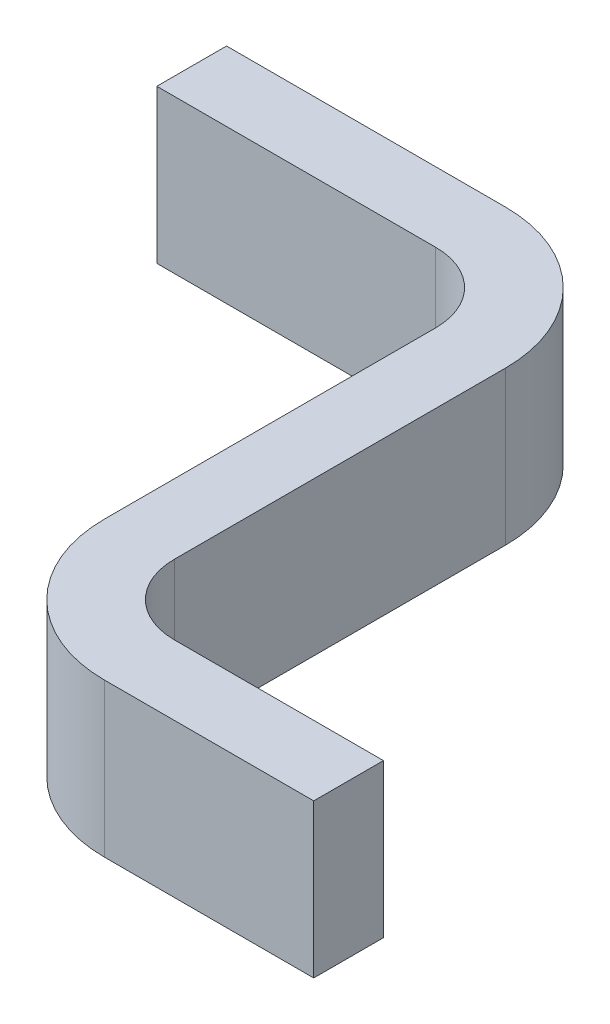
ISO-10303-21;
HEADER;
FILE_DESCRIPTION(('STEP AP214'),'2;1');
FILE_NAME('part.step','',(''),(''),'','','');
FILE_SCHEMA(('AUTOMOTIVE_DESIGN { 1 0 10303 214 1 1 1 1 }'));
ENDSEC;
DATA;
#1=APPLICATION_CONTEXT('core data for automotive mechanical design processes');
#2=APPLICATION_PROTOCOL_DEFINITION('international standard','automotive_design',2000,#1);
#3=PRODUCT_CONTEXT('',#1,'mechanical');
#4=PRODUCT('Part','Part','',(#3));
#5=PRODUCT_RELATED_PRODUCT_CATEGORY('part','',(#4));
#6=PRODUCT_DEFINITION_FORMATION('','',#4);
#7=PRODUCT_DEFINITION_CONTEXT('part definition',#1,'design');
#8=PRODUCT_DEFINITION('design','',#6,#7);
#9=PRODUCT_DEFINITION_SHAPE('','',#8);
#10=(LENGTH_UNIT() NAMED_UNIT(*) SI_UNIT(.MILLI.,.METRE.));
#11=(NAMED_UNIT(*) PLANE_ANGLE_UNIT() SI_UNIT($,.RADIAN.));
#12=(NAMED_UNIT(*) SI_UNIT($,.STERADIAN.) SOLID_ANGLE_UNIT());
#13=UNCERTAINTY_MEASURE_WITH_UNIT(LENGTH_MEASURE(1.E-05),#10,'distance_accuracy_value','');
#14=(GEOMETRIC_REPRESENTATION_CONTEXT(3) GLOBAL_UNCERTAINTY_ASSIGNED_CONTEXT((#13)) GLOBAL_UNIT_ASSIGNED_CONTEXT((#10,
#11,#12)) REPRESENTATION_CONTEXT('',''));
#15=CARTESIAN_POINT('',(0.,0.,0.));
#16=DIRECTION('',(0.,0.,1.));
#17=DIRECTION('',(1.,0.,0.));
#18=AXIS2_PLACEMENT_3D('',#15,#16,#17);
#19=CARTESIAN_POINT('',(-3.9,-0.36,0.675));
#20=DIRECTION('',(0.,1.,0.));
#21=DIRECTION('',(-1.,0.,0.));
#22=AXIS2_PLACEMENT_3D('',#19,#20,#21);
#23=PLANE('',#22);
#24=CARTESIAN_POINT('',(-3.8,-0.36,0.675));
#25=DIRECTION('',(0.,1.,0.));
#26=DIRECTION('',(-1.,0.,0.));
#27=AXIS2_PLACEMENT_3D('',#24,#25,#26);
#28=CIRCLE('',#27,0.1);
#29=CARTESIAN_POINT('',(-3.9,-0.36,0.675));
#30=VERTEX_POINT('',#29);
#31=CARTESIAN_POINT('',(-3.8,-0.36,0.775));
#32=VERTEX_POINT('',#31);
#33=EDGE_CURVE('E162',#30,#32,#28,.T.);
#34=ORIENTED_EDGE('',*,*,#33,.T.);
#35=DIRECTION('',(1.,0.,0.));
#36=VECTOR('',#35,1.);
#37=CARTESIAN_POINT('',(-3.5,-0.36,0.775));
#38=LINE('',#37,#36);
#39=CARTESIAN_POINT('',(-3.5,-0.36,0.775));
#40=VERTEX_POINT('',#39);
#41=EDGE_CURVE('E120',#32,#40,#38,.T.);
#42=ORIENTED_EDGE('',*,*,#41,.T.);
#43=DIRECTION('',(0.,0.,1.));
#44=VECTOR('',#43,1.);
#45=CARTESIAN_POINT('',(-3.5,-0.36,0.775));
#46=LINE('',#45,#44);
#47=CARTESIAN_POINT('',(-3.5,-0.36,0.875));
#48=VERTEX_POINT('',#47);
#49=EDGE_CURVE('E116',#48,#40,#46,.F.);
#50=ORIENTED_EDGE('',*,*,#49,.F.);
#51=DIRECTION('',(-1.,0.,0.));
#52=VECTOR('',#51,1.);
#53=CARTESIAN_POINT('',(-3.5,-0.36,0.875));
#54=LINE('',#53,#52);
#55=CARTESIAN_POINT('',(-3.8,-0.36,0.875));
#56=VERTEX_POINT('',#55);
#57=EDGE_CURVE('E111',#48,#56,#54,.T.);
#58=ORIENTED_EDGE('',*,*,#57,.T.);
#59=CARTESIAN_POINT('',(-3.8,-0.36,0.675));
#60=DIRECTION('',(0.,1.,0.));
#61=DIRECTION('',(-1.,0.,0.));
#62=AXIS2_PLACEMENT_3D('',#59,#60,#61);
#63=CIRCLE('',#62,0.2);
#64=CARTESIAN_POINT('',(-4.,-0.36,0.675));
#65=VERTEX_POINT('',#64);
#66=EDGE_CURVE('E102',#65,#56,#63,.T.);
#67=ORIENTED_EDGE('',*,*,#66,.F.);
#68=DIRECTION('',(0.,0.,1.));
#69=VECTOR('',#68,1.);
#70=CARTESIAN_POINT('',(-4.,-0.36,0.675));
#71=LINE('',#70,#69);
#72=CARTESIAN_POINT('',(-4.,-0.36,0.2));
#73=VERTEX_POINT('',#72);
#74=EDGE_CURVE('E98',#65,#73,#71,.F.);
#75=ORIENTED_EDGE('',*,*,#74,.T.);
#76=CARTESIAN_POINT('',(-4.1,-0.36,0.2));
#77=DIRECTION('',(0.,-1.,0.));
#78=DIRECTION('',(1.,0.,0.));
#79=AXIS2_PLACEMENT_3D('',#76,#77,#78);
#80=CIRCLE('',#79,0.1);
#81=CARTESIAN_POINT('',(-4.1,-0.36,0.1));
#82=VERTEX_POINT('',#81);
#83=EDGE_CURVE('E20',#73,#82,#80,.F.);
#84=ORIENTED_EDGE('',*,*,#83,.T.);
#85=DIRECTION('',(-1.,0.,0.));
#86=VECTOR('',#85,1.);
#87=CARTESIAN_POINT('',(-4.1,-0.36,0.1));
#88=LINE('',#87,#86);
#89=CARTESIAN_POINT('',(-4.5,-0.36,0.1));
#90=VERTEX_POINT('',#89);
#91=EDGE_CURVE('E145',#82,#90,#88,.T.);
#92=ORIENTED_EDGE('',*,*,#91,.T.);
#93=DIRECTION('',(0.,0.,1.));
#94=VECTOR('',#93,1.);
#95=CARTESIAN_POINT('',(-4.5,-0.36,0.));
#96=LINE('',#95,#94);
#97=CARTESIAN_POINT('',(-4.5,-0.36,0.));
#98=VERTEX_POINT('',#97);
#99=EDGE_CURVE('E139',#90,#98,#96,.F.);
#100=ORIENTED_EDGE('',*,*,#99,.T.);
#101=DIRECTION('',(1.,0.,0.));
#102=VECTOR('',#101,1.);
#103=CARTESIAN_POINT('',(-4.1,-0.36,0.));
#104=LINE('',#103,#102);
#105=CARTESIAN_POINT('',(-4.1,-0.36,0.));
#106=VERTEX_POINT('',#105);
#107=EDGE_CURVE('E132',#98,#106,#104,.T.);
#108=ORIENTED_EDGE('',*,*,#107,.T.);
#109=CARTESIAN_POINT('',(-4.1,-0.36,0.2));
#110=DIRECTION('',(0.,-1.,0.));
#111=DIRECTION('',(1.,0.,0.));
#112=AXIS2_PLACEMENT_3D('',#109,#110,#111);
#113=CIRCLE('',#112,0.2);
#114=CARTESIAN_POINT('',(-3.9,-0.36,0.2));
#115=VERTEX_POINT('',#114);
#116=EDGE_CURVE('E135',#115,#106,#113,.F.);
#117=ORIENTED_EDGE('',*,*,#116,.F.);
#118=DIRECTION('',(0.,0.,1.));
#119=VECTOR('',#118,1.);
#120=CARTESIAN_POINT('',(-3.9,-0.36,0.675));
#121=LINE('',#120,#119);
#122=EDGE_CURVE('E128',#115,#30,#121,.T.);
#123=ORIENTED_EDGE('',*,*,#122,.T.);
#124=EDGE_LOOP('',(#34,#42,#50,#58,#67,#75,#84,#92,#100,#108,#117,#123));
#125=FACE_BOUND('',#124,.T.);
#126=ADVANCED_FACE('F17',(#125),#23,.F.);
#127=CARTESIAN_POINT('',(-4.1,-0.36,0.2));
#128=DIRECTION('',(0.,-1.,0.));
#129=DIRECTION('',(1.,0.,0.));
#130=AXIS2_PLACEMENT_3D('',#127,#128,#129);
#131=CYLINDRICAL_SURFACE('',#130,0.1);
#132=DIRECTION('',(0.,1.,0.));
#133=VECTOR('',#132,1.);
#134=CARTESIAN_POINT('',(-4.,-0.36,0.2));
#135=LINE('',#134,#133);
#136=CARTESIAN_POINT('',(-4.,-0.14,0.2));
#137=VERTEX_POINT('',#136);
#138=EDGE_CURVE('E91',#73,#137,#135,.T.);
#139=ORIENTED_EDGE('',*,*,#138,.T.);
#140=CARTESIAN_POINT('',(-4.1,-0.14,0.2));
#141=DIRECTION('',(0.,-1.,0.));
#142=DIRECTION('',(1.,0.,0.));
#143=AXIS2_PLACEMENT_3D('',#140,#141,#142);
#144=CIRCLE('',#143,0.1);
#145=CARTESIAN_POINT('',(-4.1,-0.14,0.1));
#146=VERTEX_POINT('',#145);
#147=EDGE_CURVE('E103',#137,#146,#144,.F.);
#148=ORIENTED_EDGE('',*,*,#147,.T.);
#149=DIRECTION('',(0.,1.,0.));
#150=VECTOR('',#149,1.);
#151=CARTESIAN_POINT('',(-4.1,-0.36,0.1));
#152=LINE('',#151,#150);
#153=EDGE_CURVE('E92',#146,#82,#152,.F.);
#154=ORIENTED_EDGE('',*,*,#153,.T.);
#155=ORIENTED_EDGE('',*,*,#83,.F.);
#156=EDGE_LOOP('',(#139,#148,#154,#155));
#157=FACE_BOUND('',#156,.T.);
#158=ADVANCED_FACE('F89',(#157),#131,.F.);
#159=CARTESIAN_POINT('',(-4.1,-0.36,0.1));
#160=DIRECTION('',(0.,0.,-1.));
#161=DIRECTION('',(-1.,0.,0.));
#162=AXIS2_PLACEMENT_3D('',#159,#160,#161);
#163=PLANE('',#162);
#164=ORIENTED_EDGE('',*,*,#153,.F.);
#165=DIRECTION('',(1.,0.,0.));
#166=VECTOR('',#165,1.);
#167=CARTESIAN_POINT('',(-4.,-0.14,0.1));
#168=LINE('',#167,#166);
#169=CARTESIAN_POINT('',(-4.5,-0.14,0.1));
#170=VERTEX_POINT('',#169);
#171=EDGE_CURVE('E105',#146,#170,#168,.F.);
#172=ORIENTED_EDGE('',*,*,#171,.T.);
#173=DIRECTION('',(0.,1.,0.));
#174=VECTOR('',#173,1.);
#175=CARTESIAN_POINT('',(-4.5,-0.14,0.1));
#176=LINE('',#175,#174);
#177=EDGE_CURVE('E142',#170,#90,#176,.F.);
#178=ORIENTED_EDGE('',*,*,#177,.T.);
#179=ORIENTED_EDGE('',*,*,#91,.F.);
#180=EDGE_LOOP('',(#164,#172,#178,#179));
#181=FACE_BOUND('',#180,.T.);
#182=ADVANCED_FACE('F187',(#181),#163,.F.);
#183=CARTESIAN_POINT('',(-4.5,-0.14,0.));
#184=DIRECTION('',(1.,0.,0.));
#185=DIRECTION('',(0.,1.,0.));
#186=AXIS2_PLACEMENT_3D('',#183,#184,#185);
#187=PLANE('',#186);
#188=ORIENTED_EDGE('',*,*,#177,.F.);
#189=DIRECTION('',(0.,0.,1.));
#190=VECTOR('',#189,1.);
#191=CARTESIAN_POINT('',(-4.5,-0.14,0.675));
#192=LINE('',#191,#190);
#193=CARTESIAN_POINT('',(-4.5,-0.14,0.));
#194=VERTEX_POINT('',#193);
#195=EDGE_CURVE('E176',#170,#194,#192,.F.);
#196=ORIENTED_EDGE('',*,*,#195,.T.);
#197=DIRECTION('',(0.,1.,0.));
#198=VECTOR('',#197,1.);
#199=CARTESIAN_POINT('',(-4.5,-0.14,0.));
#200=LINE('',#199,#198);
#201=EDGE_CURVE('E136',#194,#98,#200,.F.);
#202=ORIENTED_EDGE('',*,*,#201,.T.);
#203=ORIENTED_EDGE('',*,*,#99,.F.);
#204=EDGE_LOOP('',(#188,#196,#202,#203));
#205=FACE_BOUND('',#204,.T.);
#206=ADVANCED_FACE('F192',(#205),#187,.F.);
#207=CARTESIAN_POINT('',(-4.1,-0.14,0.));
#208=DIRECTION('',(0.,0.,1.));
#209=DIRECTION('',(1.,0.,0.));
#210=AXIS2_PLACEMENT_3D('',#207,#208,#209);
#211=PLANE('',#210);
#212=DIRECTION('',(0.,-1.,0.));
#213=VECTOR('',#212,1.);
#214=CARTESIAN_POINT('',(-4.1,-0.14,0.));
#215=LINE('',#214,#213);
#216=CARTESIAN_POINT('',(-4.1,-0.14,0.));
#217=VERTEX_POINT('',#216);
#218=EDGE_CURVE('E163',#106,#217,#215,.F.);
#219=ORIENTED_EDGE('',*,*,#218,.F.);
#220=ORIENTED_EDGE('',*,*,#107,.F.);
#221=ORIENTED_EDGE('',*,*,#201,.F.);
#222=DIRECTION('',(1.,0.,0.));
#223=VECTOR('',#222,1.);
#224=CARTESIAN_POINT('',(-4.,-0.14,0.));
#225=LINE('',#224,#223);
#226=EDGE_CURVE('E159',#194,#217,#225,.T.);
#227=ORIENTED_EDGE('',*,*,#226,.T.);
#228=EDGE_LOOP('',(#219,#220,#221,#227));
#229=FACE_BOUND('',#228,.T.);
#230=ADVANCED_FACE('F264',(#229),#211,.F.);
#231=CARTESIAN_POINT('',(-4.1,-0.14,0.2));
#232=DIRECTION('',(0.,-1.,0.));
#233=DIRECTION('',(1.,0.,0.));
#234=AXIS2_PLACEMENT_3D('',#231,#232,#233);
#235=CYLINDRICAL_SURFACE('',#234,0.2);
#236=ORIENTED_EDGE('',*,*,#116,.T.);
#237=ORIENTED_EDGE('',*,*,#218,.T.);
#238=CARTESIAN_POINT('',(-4.1,-0.14,0.2));
#239=DIRECTION('',(0.,-1.,0.));
#240=DIRECTION('',(1.,0.,0.));
#241=AXIS2_PLACEMENT_3D('',#238,#239,#240);
#242=CIRCLE('',#241,0.2);
#243=CARTESIAN_POINT('',(-3.9,-0.14,0.2));
#244=VERTEX_POINT('',#243);
#245=EDGE_CURVE('E157',#217,#244,#242,.T.);
#246=ORIENTED_EDGE('',*,*,#245,.T.);
#247=DIRECTION('',(0.,-1.,0.));
#248=VECTOR('',#247,1.);
#249=CARTESIAN_POINT('',(-3.9,-0.14,0.2));
#250=LINE('',#249,#248);
#251=EDGE_CURVE('E131',#244,#115,#250,.T.);
#252=ORIENTED_EDGE('',*,*,#251,.T.);
#253=EDGE_LOOP('',(#236,#237,#246,#252));
#254=FACE_BOUND('',#253,.T.);
#255=ADVANCED_FACE('F266',(#254),#235,.T.);
#256=CARTESIAN_POINT('',(-3.9,-0.14,0.675));
#257=DIRECTION('',(-1.,0.,0.));
#258=DIRECTION('',(0.,-1.,0.));
#259=AXIS2_PLACEMENT_3D('',#256,#257,#258);
#260=PLANE('',#259);
#261=DIRECTION('',(0.,1.,0.));
#262=VECTOR('',#261,1.);
#263=CARTESIAN_POINT('',(-3.9,-0.14,0.675));
#264=LINE('',#263,#262);
#265=CARTESIAN_POINT('',(-3.9,-0.14,0.675));
#266=VERTEX_POINT('',#265);
#267=EDGE_CURVE('E130',#266,#30,#264,.F.);
#268=ORIENTED_EDGE('',*,*,#267,.T.);
#269=ORIENTED_EDGE('',*,*,#122,.F.);
#270=ORIENTED_EDGE('',*,*,#251,.F.);
#271=DIRECTION('',(0.,0.,1.));
#272=VECTOR('',#271,1.);
#273=CARTESIAN_POINT('',(-3.9,-0.14,0.675));
#274=LINE('',#273,#272);
#275=EDGE_CURVE('E156',#244,#266,#274,.T.);
#276=ORIENTED_EDGE('',*,*,#275,.T.);
#277=EDGE_LOOP('',(#268,#269,#270,#276));
#278=FACE_BOUND('',#277,.T.);
#279=ADVANCED_FACE('F231',(#278),#260,.F.);
#280=CARTESIAN_POINT('',(-3.8,-0.14,0.675));
#281=DIRECTION('',(0.,1.,0.));
#282=DIRECTION('',(-1.,0.,0.));
#283=AXIS2_PLACEMENT_3D('',#280,#281,#282);
#284=CYLINDRICAL_SURFACE('',#283,0.1);
#285=DIRECTION('',(0.,1.,0.));
#286=VECTOR('',#285,1.);
#287=CARTESIAN_POINT('',(-3.8,-0.14,0.775));
#288=LINE('',#287,#286);
#289=CARTESIAN_POINT('',(-3.8,-0.14,0.775));
#290=VERTEX_POINT('',#289);
#291=EDGE_CURVE('E125',#290,#32,#288,.F.);
#292=ORIENTED_EDGE('',*,*,#291,.T.);
#293=ORIENTED_EDGE('',*,*,#33,.F.);
#294=ORIENTED_EDGE('',*,*,#267,.F.);
#295=CARTESIAN_POINT('',(-3.8,-0.14,0.675));
#296=DIRECTION('',(0.,1.,0.));
#297=DIRECTION('',(-1.,0.,0.));
#298=AXIS2_PLACEMENT_3D('',#295,#296,#297);
#299=CIRCLE('',#298,0.1);
#300=EDGE_CURVE('E152',#266,#290,#299,.T.);
#301=ORIENTED_EDGE('',*,*,#300,.T.);
#302=EDGE_LOOP('',(#292,#293,#294,#301));
#303=FACE_BOUND('',#302,.T.);
#304=ADVANCED_FACE('F235',(#303),#284,.F.);
#305=CARTESIAN_POINT('',(-3.5,-0.14,0.775));
#306=DIRECTION('',(0.,0.,1.));
#307=DIRECTION('',(1.,0.,0.));
#308=AXIS2_PLACEMENT_3D('',#305,#306,#307);
#309=PLANE('',#308);
#310=DIRECTION('',(0.,1.,0.));
#311=VECTOR('',#310,1.);
#312=CARTESIAN_POINT('',(-3.5,-0.14,0.775));
#313=LINE('',#312,#311);
#314=CARTESIAN_POINT('',(-3.5,-0.14,0.775));
#315=VERTEX_POINT('',#314);
#316=EDGE_CURVE('E119',#40,#315,#313,.T.);
#317=ORIENTED_EDGE('',*,*,#316,.F.);
#318=ORIENTED_EDGE('',*,*,#41,.F.);
#319=ORIENTED_EDGE('',*,*,#291,.F.);
#320=DIRECTION('',(1.,0.,0.));
#321=VECTOR('',#320,1.);
#322=CARTESIAN_POINT('',(-4.,-0.14,0.775));
#323=LINE('',#322,#321);
#324=EDGE_CURVE('E155',#290,#315,#323,.T.);
#325=ORIENTED_EDGE('',*,*,#324,.T.);
#326=EDGE_LOOP('',(#317,#318,#319,#325));
#327=FACE_BOUND('',#326,.T.);
#328=ADVANCED_FACE('F259',(#327),#309,.F.);
#329=CARTESIAN_POINT('',(-3.5,-0.14,0.775));
#330=DIRECTION('',(1.,0.,0.));
#331=DIRECTION('',(0.,1.,0.));
#332=AXIS2_PLACEMENT_3D('',#329,#330,#331);
#333=PLANE('',#332);
#334=DIRECTION('',(0.,0.,1.));
#335=VECTOR('',#334,1.);
#336=CARTESIAN_POINT('',(-3.5,-0.14,0.675));
#337=LINE('',#336,#335);
#338=CARTESIAN_POINT('',(-3.5,-0.14,0.875));
#339=VERTEX_POINT('',#338);
#340=EDGE_CURVE('E217',#315,#339,#337,.T.);
#341=ORIENTED_EDGE('',*,*,#340,.T.);
#342=DIRECTION('',(0.,1.,0.));
#343=VECTOR('',#342,1.);
#344=CARTESIAN_POINT('',(-3.5,-0.36,0.875));
#345=LINE('',#344,#343);
#346=EDGE_CURVE('E113',#339,#48,#345,.F.);
#347=ORIENTED_EDGE('',*,*,#346,.T.);
#348=ORIENTED_EDGE('',*,*,#49,.T.);
#349=ORIENTED_EDGE('',*,*,#316,.T.);
#350=EDGE_LOOP('',(#341,#347,#348,#349));
#351=FACE_BOUND('',#350,.T.);
#352=ADVANCED_FACE('F255',(#351),#333,.T.);
#353=CARTESIAN_POINT('',(-3.5,-0.36,0.875));
#354=DIRECTION('',(0.,0.,-1.));
#355=DIRECTION('',(-1.,0.,0.));
#356=AXIS2_PLACEMENT_3D('',#353,#354,#355);
#357=PLANE('',#356);
#358=ORIENTED_EDGE('',*,*,#346,.F.);
#359=DIRECTION('',(1.,0.,0.));
#360=VECTOR('',#359,1.);
#361=CARTESIAN_POINT('',(-4.,-0.14,0.875));
#362=LINE('',#361,#360);
#363=CARTESIAN_POINT('',(-3.8,-0.14,0.875));
#364=VERTEX_POINT('',#363);
#365=EDGE_CURVE('E151',#339,#364,#362,.F.);
#366=ORIENTED_EDGE('',*,*,#365,.T.);
#367=DIRECTION('',(0.,1.,0.));
#368=VECTOR('',#367,1.);
#369=CARTESIAN_POINT('',(-3.8,-0.36,0.875));
#370=LINE('',#369,#368);
#371=EDGE_CURVE('E99',#56,#364,#370,.T.);
#372=ORIENTED_EDGE('',*,*,#371,.F.);
#373=ORIENTED_EDGE('',*,*,#57,.F.);
#374=EDGE_LOOP('',(#358,#366,#372,#373));
#375=FACE_BOUND('',#374,.T.);
#376=ADVANCED_FACE('F251',(#375),#357,.F.);
#377=CARTESIAN_POINT('',(-3.8,-0.36,0.675));
#378=DIRECTION('',(0.,1.,0.));
#379=DIRECTION('',(-1.,0.,0.));
#380=AXIS2_PLACEMENT_3D('',#377,#378,#379);
#381=CYLINDRICAL_SURFACE('',#380,0.2);
#382=CARTESIAN_POINT('',(-3.8,-0.14,0.675));
#383=DIRECTION('',(0.,1.,0.));
#384=DIRECTION('',(-1.,0.,0.));
#385=AXIS2_PLACEMENT_3D('',#382,#383,#384);
#386=CIRCLE('',#385,0.2);
#387=CARTESIAN_POINT('',(-4.,-0.14,0.675));
#388=VERTEX_POINT('',#387);
#389=EDGE_CURVE('E26',#364,#388,#386,.F.);
#390=ORIENTED_EDGE('',*,*,#389,.T.);
#391=DIRECTION('',(0.,1.,0.));
#392=VECTOR('',#391,1.);
#393=CARTESIAN_POINT('',(-4.,-0.36,0.675));
#394=LINE('',#393,#392);
#395=EDGE_CURVE('E34',#388,#65,#394,.F.);
#396=ORIENTED_EDGE('',*,*,#395,.T.);
#397=ORIENTED_EDGE('',*,*,#66,.T.);
#398=ORIENTED_EDGE('',*,*,#371,.T.);
#399=EDGE_LOOP('',(#390,#396,#397,#398));
#400=FACE_BOUND('',#399,.T.);
#401=ADVANCED_FACE('F280',(#400),#381,.T.);
#402=CARTESIAN_POINT('',(-4.,-0.36,0.675));
#403=DIRECTION('',(1.,0.,0.));
#404=DIRECTION('',(0.,1.,0.));
#405=AXIS2_PLACEMENT_3D('',#402,#403,#404);
#406=PLANE('',#405);
#407=ORIENTED_EDGE('',*,*,#395,.F.);
#408=DIRECTION('',(0.,0.,1.));
#409=VECTOR('',#408,1.);
#410=CARTESIAN_POINT('',(-4.,-0.14,0.675));
#411=LINE('',#410,#409);
#412=EDGE_CURVE('E11',#388,#137,#411,.F.);
#413=ORIENTED_EDGE('',*,*,#412,.T.);
#414=ORIENTED_EDGE('',*,*,#138,.F.);
#415=ORIENTED_EDGE('',*,*,#74,.F.);
#416=EDGE_LOOP('',(#407,#413,#414,#415));
#417=FACE_BOUND('',#416,.T.);
#418=ADVANCED_FACE('F97',(#417),#406,.F.);
#419=CARTESIAN_POINT('',(-4.,-0.14,0.675));
#420=DIRECTION('',(0.,-1.,0.));
#421=DIRECTION('',(1.,0.,0.));
#422=AXIS2_PLACEMENT_3D('',#419,#420,#421);
#423=PLANE('',#422);
#424=ORIENTED_EDGE('',*,*,#389,.F.);
#425=ORIENTED_EDGE('',*,*,#365,.F.);
#426=ORIENTED_EDGE('',*,*,#340,.F.);
#427=ORIENTED_EDGE('',*,*,#324,.F.);
#428=ORIENTED_EDGE('',*,*,#300,.F.);
#429=ORIENTED_EDGE('',*,*,#275,.F.);
#430=ORIENTED_EDGE('',*,*,#245,.F.);
#431=ORIENTED_EDGE('',*,*,#226,.F.);
#432=ORIENTED_EDGE('',*,*,#195,.F.);
#433=ORIENTED_EDGE('',*,*,#171,.F.);
#434=ORIENTED_EDGE('',*,*,#147,.F.);
#435=ORIENTED_EDGE('',*,*,#412,.F.);
#436=EDGE_LOOP('',(#424,#425,#426,#427,#428,#429,#430,#431,#432,#433,#434,#435));
#437=FACE_BOUND('',#436,.T.);
#438=ADVANCED_FACE('F197',(#437),#423,.F.);
#439=CLOSED_SHELL('',(#126,#158,#182,#206,#230,#255,#279,#304,#328,#352,#376,#401,#418,#438));
#440=MANIFOLD_SOLID_BREP('B1',#439);
#441=ADVANCED_BREP_SHAPE_REPRESENTATION('',(#18,#440),#14);
#442=SHAPE_DEFINITION_REPRESENTATION(#9,#441);
ENDSEC;
END-ISO-10303-21;
